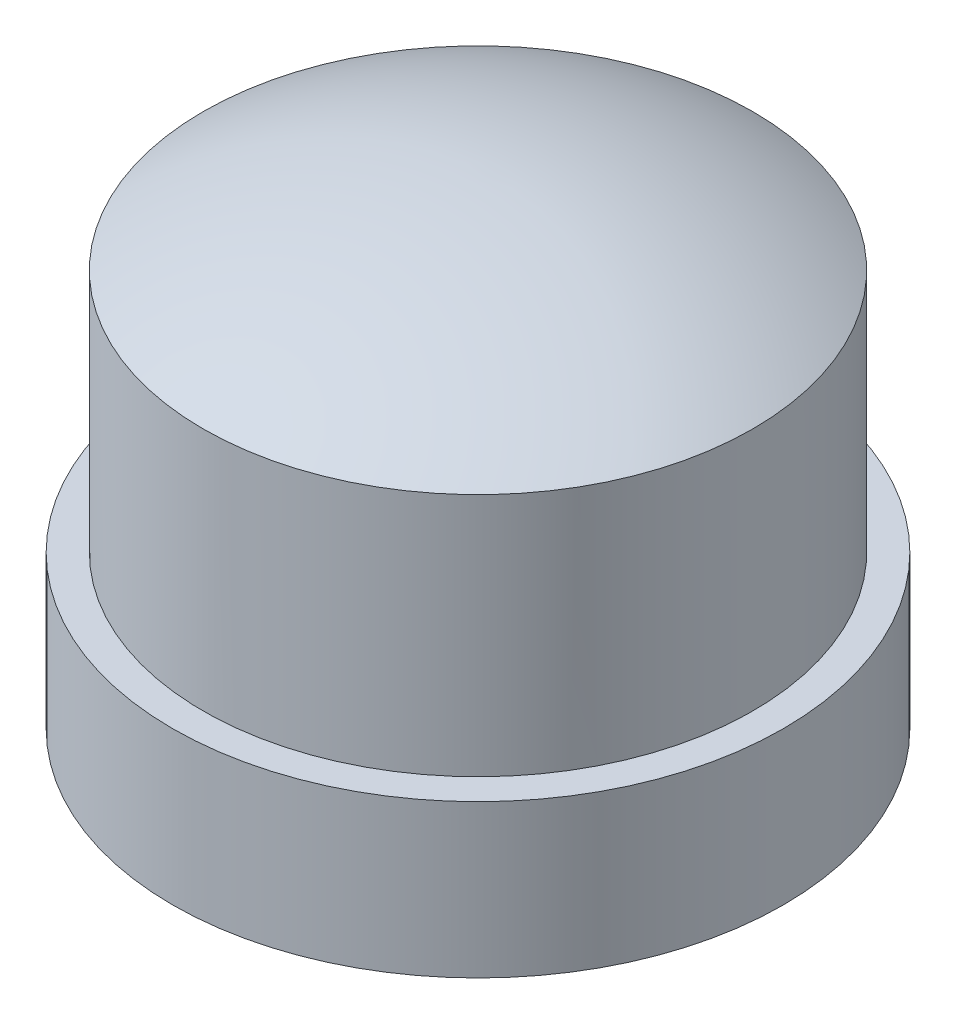
ISO-10303-21;
HEADER;
FILE_DESCRIPTION(('STEP AP214'),'2;1');
FILE_NAME('part.step','',(''),(''),'','','');
FILE_SCHEMA(('AUTOMOTIVE_DESIGN { 1 0 10303 214 1 1 1 1 }'));
ENDSEC;
DATA;
#1=APPLICATION_CONTEXT('core data for automotive mechanical design processes');
#2=APPLICATION_PROTOCOL_DEFINITION('international standard','automotive_design',2000,#1);
#3=PRODUCT_CONTEXT('',#1,'mechanical');
#4=PRODUCT('Part','Part','',(#3));
#5=PRODUCT_RELATED_PRODUCT_CATEGORY('part','',(#4));
#6=PRODUCT_DEFINITION_FORMATION('','',#4);
#7=PRODUCT_DEFINITION_CONTEXT('part definition',#1,'design');
#8=PRODUCT_DEFINITION('design','',#6,#7);
#9=PRODUCT_DEFINITION_SHAPE('','',#8);
#10=(LENGTH_UNIT() NAMED_UNIT(*) SI_UNIT(.MILLI.,.METRE.));
#11=(NAMED_UNIT(*) PLANE_ANGLE_UNIT() SI_UNIT($,.RADIAN.));
#12=(NAMED_UNIT(*) SI_UNIT($,.STERADIAN.) SOLID_ANGLE_UNIT());
#13=UNCERTAINTY_MEASURE_WITH_UNIT(LENGTH_MEASURE(1.E-05),#10,'distance_accuracy_value','');
#14=(GEOMETRIC_REPRESENTATION_CONTEXT(3) GLOBAL_UNCERTAINTY_ASSIGNED_CONTEXT((#13)) GLOBAL_UNIT_ASSIGNED_CONTEXT((#10,
#11,#12)) REPRESENTATION_CONTEXT('',''));
#15=CARTESIAN_POINT('',(0.,0.,0.));
#16=DIRECTION('',(0.,0.,1.));
#17=DIRECTION('',(1.,0.,0.));
#18=AXIS2_PLACEMENT_3D('',#15,#16,#17);
#19=CARTESIAN_POINT('',(0.,5.,0.));
#20=DIRECTION('',(0.,-1.,0.));
#21=DIRECTION('',(0.,0.,-1.));
#22=AXIS2_PLACEMENT_3D('',#19,#20,#21);
#23=CYLINDRICAL_SURFACE('',#22,10.);
#24=CARTESIAN_POINT('',(0.,5.,0.));
#25=DIRECTION('',(0.,1.,0.));
#26=DIRECTION('',(0.,0.,1.));
#27=AXIS2_PLACEMENT_3D('',#24,#25,#26);
#28=CIRCLE('',#27,10.);
#29=CARTESIAN_POINT('',(0.,5.,10.));
#30=VERTEX_POINT('',#29);
#31=EDGE_CURVE('E10',#30,#30,#28,.T.);
#32=ORIENTED_EDGE('',*,*,#31,.F.);
#33=EDGE_LOOP('',(#32));
#34=FACE_BOUND('',#33,.T.);
#35=CARTESIAN_POINT('',(0.,0.,0.));
#36=DIRECTION('',(0.,1.,0.));
#37=DIRECTION('',(0.,0.,1.));
#38=AXIS2_PLACEMENT_3D('',#35,#36,#37);
#39=CIRCLE('',#38,10.);
#40=CARTESIAN_POINT('',(0.,0.,10.));
#41=VERTEX_POINT('',#40);
#42=EDGE_CURVE('E33',#41,#41,#39,.T.);
#43=ORIENTED_EDGE('',*,*,#42,.T.);
#44=EDGE_LOOP('',(#43));
#45=FACE_BOUND('',#44,.T.);
#46=ADVANCED_FACE('F30',(#34,#45),#23,.T.);
#47=CARTESIAN_POINT('',(0.,5.,0.));
#48=DIRECTION('',(0.,1.,0.));
#49=DIRECTION('',(0.,0.,1.));
#50=AXIS2_PLACEMENT_3D('',#47,#48,#49);
#51=PLANE('',#50);
#52=CARTESIAN_POINT('',(0.,5.,0.));
#53=DIRECTION('',(0.,-1.,0.));
#54=DIRECTION('',(0.,0.,-1.));
#55=AXIS2_PLACEMENT_3D('',#52,#53,#54);
#56=CIRCLE('',#55,9.);
#57=CARTESIAN_POINT('',(0.,5.,-9.));
#58=VERTEX_POINT('',#57);
#59=EDGE_CURVE('E40',#58,#58,#56,.T.);
#60=ORIENTED_EDGE('',*,*,#59,.T.);
#61=EDGE_LOOP('',(#60));
#62=FACE_BOUND('',#61,.T.);
#63=ORIENTED_EDGE('',*,*,#31,.T.);
#64=EDGE_LOOP('',(#63));
#65=FACE_BOUND('',#64,.T.);
#66=ADVANCED_FACE('F60',(#62,#65),#51,.T.);
#67=CARTESIAN_POINT('',(0.,0.,0.));
#68=DIRECTION('',(0.,1.,0.));
#69=DIRECTION('',(0.,0.,1.));
#70=AXIS2_PLACEMENT_3D('',#67,#68,#69);
#71=PLANE('',#70);
#72=ORIENTED_EDGE('',*,*,#42,.F.);
#73=EDGE_LOOP('',(#72));
#74=FACE_BOUND('',#73,.T.);
#75=ADVANCED_FACE('F56',(#74),#71,.F.);
#76=CARTESIAN_POINT('',(0.,5.,0.));
#77=DIRECTION('',(0.,-1.,0.));
#78=DIRECTION('',(0.,0.,-1.));
#79=AXIS2_PLACEMENT_3D('',#76,#77,#78);
#80=CYLINDRICAL_SURFACE('',#79,9.);
#81=ORIENTED_EDGE('',*,*,#59,.F.);
#82=EDGE_LOOP('',(#81));
#83=FACE_BOUND('',#82,.T.);
#84=CARTESIAN_POINT('',(0.,13.,0.));
#85=DIRECTION('',(0.,-1.,0.));
#86=DIRECTION('',(0.,0.,-1.));
#87=AXIS2_PLACEMENT_3D('',#84,#85,#86);
#88=CIRCLE('',#87,9.);
#89=CARTESIAN_POINT('',(0.,13.,-9.));
#90=VERTEX_POINT('',#89);
#91=EDGE_CURVE('E44',#90,#90,#88,.T.);
#92=ORIENTED_EDGE('',*,*,#91,.T.);
#93=EDGE_LOOP('',(#92));
#94=FACE_BOUND('',#93,.T.);
#95=ADVANCED_FACE('F48',(#83,#94),#80,.T.);
#96=CARTESIAN_POINT('',(0.,-1.94999999999999,0.));
#97=DIRECTION('',(0.,-1.,0.));
#98=DIRECTION('',(0.,0.,1.));
#99=AXIS2_PLACEMENT_3D('',#96,#97,#98);
#100=SPHERICAL_SURFACE('',#99,17.45);
#101=ORIENTED_EDGE('',*,*,#91,.F.);
#102=EDGE_LOOP('',(#101));
#103=FACE_BOUND('',#102,.T.);
#104=ADVANCED_FACE('F50',(#103),#100,.T.);
#105=CLOSED_SHELL('',(#46,#66,#75,#95,#104));
#106=MANIFOLD_SOLID_BREP('B2',#105);
#107=ADVANCED_BREP_SHAPE_REPRESENTATION('',(#18,#106),#14);
#108=SHAPE_DEFINITION_REPRESENTATION(#9,#107);
ENDSEC;
END-ISO-10303-21;
